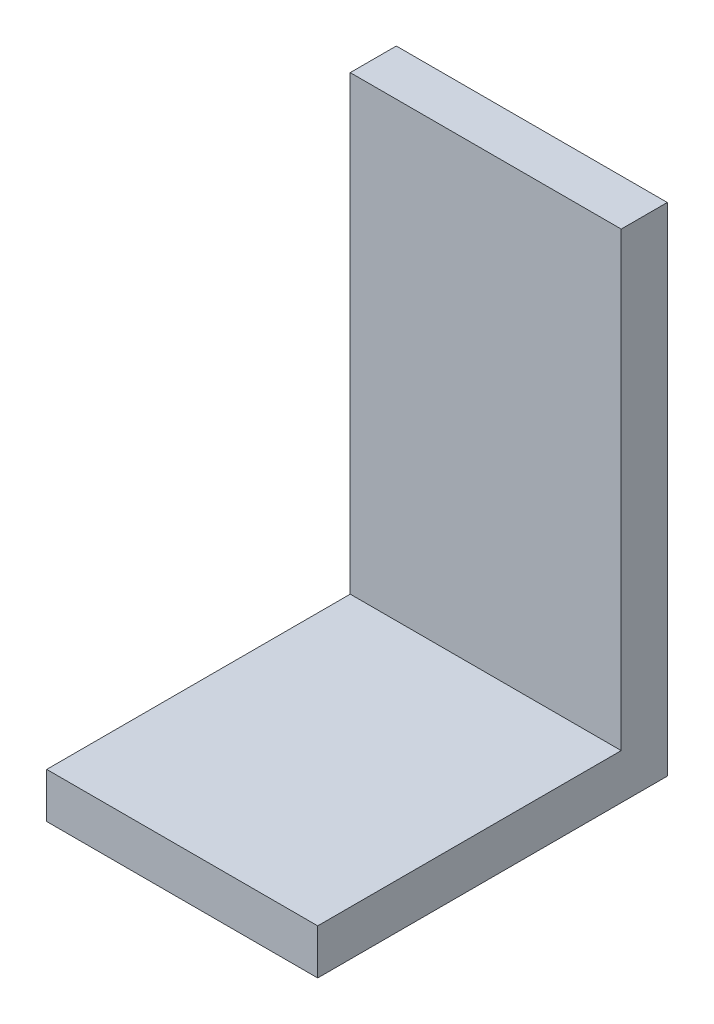
ISO-10303-21;
HEADER;
FILE_DESCRIPTION(('STEP AP214'),'2;1');
FILE_NAME('part.step','',(''),(''),'','','');
FILE_SCHEMA(('AUTOMOTIVE_DESIGN { 1 0 10303 214 1 1 1 1 }'));
ENDSEC;
DATA;
#1=APPLICATION_CONTEXT('core data for automotive mechanical design processes');
#2=APPLICATION_PROTOCOL_DEFINITION('international standard','automotive_design',2000,#1);
#3=PRODUCT_CONTEXT('',#1,'mechanical');
#4=PRODUCT('Part','Part','',(#3));
#5=PRODUCT_RELATED_PRODUCT_CATEGORY('part','',(#4));
#6=PRODUCT_DEFINITION_FORMATION('','',#4);
#7=PRODUCT_DEFINITION_CONTEXT('part definition',#1,'design');
#8=PRODUCT_DEFINITION('design','',#6,#7);
#9=PRODUCT_DEFINITION_SHAPE('','',#8);
#10=(LENGTH_UNIT() NAMED_UNIT(*) SI_UNIT(.MILLI.,.METRE.));
#11=(NAMED_UNIT(*) PLANE_ANGLE_UNIT() SI_UNIT($,.RADIAN.));
#12=(NAMED_UNIT(*) SI_UNIT($,.STERADIAN.) SOLID_ANGLE_UNIT());
#13=UNCERTAINTY_MEASURE_WITH_UNIT(LENGTH_MEASURE(1.E-05),#10,'distance_accuracy_value','');
#14=(GEOMETRIC_REPRESENTATION_CONTEXT(3) GLOBAL_UNCERTAINTY_ASSIGNED_CONTEXT((#13)) GLOBAL_UNIT_ASSIGNED_CONTEXT((#10,
#11,#12)) REPRESENTATION_CONTEXT('',''));
#15=CARTESIAN_POINT('',(0.,0.,0.));
#16=DIRECTION('',(0.,0.,1.));
#17=DIRECTION('',(1.,0.,0.));
#18=AXIS2_PLACEMENT_3D('',#15,#16,#17);
#19=CARTESIAN_POINT('',(-3.6,-4.55,0.));
#20=DIRECTION('',(1.,0.,0.));
#21=DIRECTION('',(0.,0.,1.));
#22=AXIS2_PLACEMENT_3D('',#19,#20,#21);
#23=PLANE('',#22);
#24=DIRECTION('',(0.,-1.,0.));
#25=VECTOR('',#24,1.);
#26=CARTESIAN_POINT('',(-3.6,-4.,0.));
#27=LINE('',#26,#25);
#28=CARTESIAN_POINT('',(-3.6,-4.,0.));
#29=VERTEX_POINT('',#28);
#30=CARTESIAN_POINT('',(-3.6,-4.55,0.));
#31=VERTEX_POINT('',#30);
#32=EDGE_CURVE('E11',#29,#31,#27,.T.);
#33=ORIENTED_EDGE('',*,*,#32,.F.);
#34=DIRECTION('',(0.,0.,-1.));
#35=VECTOR('',#34,1.);
#36=CARTESIAN_POINT('',(-3.6,-4.,0.051));
#37=LINE('',#36,#35);
#38=CARTESIAN_POINT('',(-3.6,-4.,0.051));
#39=VERTEX_POINT('',#38);
#40=EDGE_CURVE('E24',#39,#29,#37,.T.);
#41=ORIENTED_EDGE('',*,*,#40,.F.);
#42=DIRECTION('',(0.,1.,0.));
#43=VECTOR('',#42,1.);
#44=CARTESIAN_POINT('',(-3.6,-4.5,0.051));
#45=LINE('',#44,#43);
#46=CARTESIAN_POINT('',(-3.6,-4.5,0.051));
#47=VERTEX_POINT('',#46);
#48=EDGE_CURVE('E87',#47,#39,#45,.T.);
#49=ORIENTED_EDGE('',*,*,#48,.F.);
#50=DIRECTION('',(0.,0.,-1.));
#51=VECTOR('',#50,1.);
#52=CARTESIAN_POINT('',(-3.6,-4.5,0.387));
#53=LINE('',#52,#51);
#54=CARTESIAN_POINT('',(-3.6,-4.5,0.387));
#55=VERTEX_POINT('',#54);
#56=EDGE_CURVE('E114',#55,#47,#53,.T.);
#57=ORIENTED_EDGE('',*,*,#56,.F.);
#58=DIRECTION('',(0.,1.,0.));
#59=VECTOR('',#58,1.);
#60=CARTESIAN_POINT('',(-3.6,-4.55,0.387));
#61=LINE('',#60,#59);
#62=CARTESIAN_POINT('',(-3.6,-4.55,0.387));
#63=VERTEX_POINT('',#62);
#64=EDGE_CURVE('E111',#63,#55,#61,.T.);
#65=ORIENTED_EDGE('',*,*,#64,.F.);
#66=DIRECTION('',(0.,0.,1.));
#67=VECTOR('',#66,1.);
#68=CARTESIAN_POINT('',(-3.6,-4.55,0.));
#69=LINE('',#68,#67);
#70=EDGE_CURVE('E108',#31,#63,#69,.T.);
#71=ORIENTED_EDGE('',*,*,#70,.F.);
#72=EDGE_LOOP('',(#33,#41,#49,#57,#65,#71));
#73=FACE_BOUND('',#72,.T.);
#74=ADVANCED_FACE('F17',(#73),#23,.T.);
#75=CARTESIAN_POINT('',(-3.9,-4.,0.));
#76=DIRECTION('',(-1.,0.,0.));
#77=DIRECTION('',(0.,0.,1.));
#78=AXIS2_PLACEMENT_3D('',#75,#76,#77);
#79=PLANE('',#78);
#80=DIRECTION('',(0.,1.,0.));
#81=VECTOR('',#80,1.);
#82=CARTESIAN_POINT('',(-3.9,-4.55,0.));
#83=LINE('',#82,#81);
#84=CARTESIAN_POINT('',(-3.9,-4.55,0.));
#85=VERTEX_POINT('',#84);
#86=CARTESIAN_POINT('',(-3.9,-4.,0.));
#87=VERTEX_POINT('',#86);
#88=EDGE_CURVE('E106',#85,#87,#83,.T.);
#89=ORIENTED_EDGE('',*,*,#88,.F.);
#90=DIRECTION('',(0.,0.,-1.));
#91=VECTOR('',#90,1.);
#92=CARTESIAN_POINT('',(-3.9,-4.55,0.387));
#93=LINE('',#92,#91);
#94=CARTESIAN_POINT('',(-3.9,-4.55,0.387));
#95=VERTEX_POINT('',#94);
#96=EDGE_CURVE('E103',#95,#85,#93,.T.);
#97=ORIENTED_EDGE('',*,*,#96,.F.);
#98=DIRECTION('',(0.,-1.,0.));
#99=VECTOR('',#98,1.);
#100=CARTESIAN_POINT('',(-3.9,-4.5,0.387));
#101=LINE('',#100,#99);
#102=CARTESIAN_POINT('',(-3.9,-4.5,0.387));
#103=VERTEX_POINT('',#102);
#104=EDGE_CURVE('E100',#103,#95,#101,.T.);
#105=ORIENTED_EDGE('',*,*,#104,.F.);
#106=DIRECTION('',(0.,0.,1.));
#107=VECTOR('',#106,1.);
#108=CARTESIAN_POINT('',(-3.9,-4.5,0.051));
#109=LINE('',#108,#107);
#110=CARTESIAN_POINT('',(-3.9,-4.5,0.051));
#111=VERTEX_POINT('',#110);
#112=EDGE_CURVE('E72',#111,#103,#109,.T.);
#113=ORIENTED_EDGE('',*,*,#112,.F.);
#114=DIRECTION('',(0.,-1.,0.));
#115=VECTOR('',#114,1.);
#116=CARTESIAN_POINT('',(-3.9,-4.,0.051));
#117=LINE('',#116,#115);
#118=CARTESIAN_POINT('',(-3.9,-4.,0.051));
#119=VERTEX_POINT('',#118);
#120=EDGE_CURVE('E66',#119,#111,#117,.T.);
#121=ORIENTED_EDGE('',*,*,#120,.F.);
#122=DIRECTION('',(0.,0.,1.));
#123=VECTOR('',#122,1.);
#124=CARTESIAN_POINT('',(-3.9,-4.,0.));
#125=LINE('',#124,#123);
#126=EDGE_CURVE('E69',#87,#119,#125,.T.);
#127=ORIENTED_EDGE('',*,*,#126,.F.);
#128=EDGE_LOOP('',(#89,#97,#105,#113,#121,#127));
#129=FACE_BOUND('',#128,.T.);
#130=ADVANCED_FACE('F68',(#129),#79,.T.);
#131=CARTESIAN_POINT('',(-3.6,-4.55,0.387));
#132=DIRECTION('',(0.,0.,1.));
#133=DIRECTION('',(0.,1.,0.));
#134=AXIS2_PLACEMENT_3D('',#131,#132,#133);
#135=PLANE('',#134);
#136=ORIENTED_EDGE('',*,*,#64,.T.);
#137=DIRECTION('',(1.,0.,0.));
#138=VECTOR('',#137,1.);
#139=CARTESIAN_POINT('',(-3.9,-4.5,0.387));
#140=LINE('',#139,#138);
#141=EDGE_CURVE('E83',#103,#55,#140,.T.);
#142=ORIENTED_EDGE('',*,*,#141,.F.);
#143=ORIENTED_EDGE('',*,*,#104,.T.);
#144=DIRECTION('',(-1.,0.,0.));
#145=VECTOR('',#144,1.);
#146=CARTESIAN_POINT('',(-3.6,-4.55,0.387));
#147=LINE('',#146,#145);
#148=EDGE_CURVE('E88',#63,#95,#147,.T.);
#149=ORIENTED_EDGE('',*,*,#148,.F.);
#150=EDGE_LOOP('',(#136,#142,#143,#149));
#151=FACE_BOUND('',#150,.T.);
#152=ADVANCED_FACE('F125',(#151),#135,.T.);
#153=CARTESIAN_POINT('',(-3.6,-4.5,0.051));
#154=DIRECTION('',(0.,0.,1.));
#155=DIRECTION('',(0.,1.,0.));
#156=AXIS2_PLACEMENT_3D('',#153,#154,#155);
#157=PLANE('',#156);
#158=ORIENTED_EDGE('',*,*,#48,.T.);
#159=DIRECTION('',(1.,0.,0.));
#160=VECTOR('',#159,1.);
#161=CARTESIAN_POINT('',(-3.9,-4.,0.051));
#162=LINE('',#161,#160);
#163=EDGE_CURVE('E81',#119,#39,#162,.T.);
#164=ORIENTED_EDGE('',*,*,#163,.F.);
#165=ORIENTED_EDGE('',*,*,#120,.T.);
#166=DIRECTION('',(-1.,0.,0.));
#167=VECTOR('',#166,1.);
#168=CARTESIAN_POINT('',(-3.6,-4.5,0.051));
#169=LINE('',#168,#167);
#170=EDGE_CURVE('E89',#47,#111,#169,.T.);
#171=ORIENTED_EDGE('',*,*,#170,.F.);
#172=EDGE_LOOP('',(#158,#164,#165,#171));
#173=FACE_BOUND('',#172,.T.);
#174=ADVANCED_FACE('F86',(#173),#157,.T.);
#175=CARTESIAN_POINT('',(-3.9,-4.55,0.));
#176=DIRECTION('',(0.,-1.,0.));
#177=DIRECTION('',(0.,0.,1.));
#178=AXIS2_PLACEMENT_3D('',#175,#176,#177);
#179=PLANE('',#178);
#180=DIRECTION('',(-1.,0.,0.));
#181=VECTOR('',#180,1.);
#182=CARTESIAN_POINT('',(-3.6,-4.55,0.));
#183=LINE('',#182,#181);
#184=EDGE_CURVE('E93',#31,#85,#183,.T.);
#185=ORIENTED_EDGE('',*,*,#184,.F.);
#186=ORIENTED_EDGE('',*,*,#70,.T.);
#187=ORIENTED_EDGE('',*,*,#148,.T.);
#188=ORIENTED_EDGE('',*,*,#96,.T.);
#189=EDGE_LOOP('',(#185,#186,#187,#188));
#190=FACE_BOUND('',#189,.T.);
#191=ADVANCED_FACE('F121',(#190),#179,.T.);
#192=CARTESIAN_POINT('',(-3.6,-4.,0.));
#193=DIRECTION('',(0.,1.,0.));
#194=DIRECTION('',(0.,0.,1.));
#195=AXIS2_PLACEMENT_3D('',#192,#193,#194);
#196=PLANE('',#195);
#197=DIRECTION('',(1.,0.,0.));
#198=VECTOR('',#197,1.);
#199=CARTESIAN_POINT('',(-3.9,-4.,0.));
#200=LINE('',#199,#198);
#201=EDGE_CURVE('E82',#87,#29,#200,.T.);
#202=ORIENTED_EDGE('',*,*,#201,.F.);
#203=ORIENTED_EDGE('',*,*,#126,.T.);
#204=ORIENTED_EDGE('',*,*,#163,.T.);
#205=ORIENTED_EDGE('',*,*,#40,.T.);
#206=EDGE_LOOP('',(#202,#203,#204,#205));
#207=FACE_BOUND('',#206,.T.);
#208=ADVANCED_FACE('F80',(#207),#196,.T.);
#209=CARTESIAN_POINT('',(-3.6,-4.5,0.051));
#210=DIRECTION('',(0.,1.,0.));
#211=DIRECTION('',(0.,0.,1.));
#212=AXIS2_PLACEMENT_3D('',#209,#210,#211);
#213=PLANE('',#212);
#214=ORIENTED_EDGE('',*,*,#170,.T.);
#215=ORIENTED_EDGE('',*,*,#112,.T.);
#216=ORIENTED_EDGE('',*,*,#141,.T.);
#217=ORIENTED_EDGE('',*,*,#56,.T.);
#218=EDGE_LOOP('',(#214,#215,#216,#217));
#219=FACE_BOUND('',#218,.T.);
#220=ADVANCED_FACE('F127',(#219),#213,.T.);
#221=CARTESIAN_POINT('',(-3.9,-4.55,0.));
#222=DIRECTION('',(0.,0.,-1.));
#223=DIRECTION('',(0.,1.,0.));
#224=AXIS2_PLACEMENT_3D('',#221,#222,#223);
#225=PLANE('',#224);
#226=ORIENTED_EDGE('',*,*,#88,.T.);
#227=ORIENTED_EDGE('',*,*,#201,.T.);
#228=ORIENTED_EDGE('',*,*,#32,.T.);
#229=ORIENTED_EDGE('',*,*,#184,.T.);
#230=EDGE_LOOP('',(#226,#227,#228,#229));
#231=FACE_BOUND('',#230,.T.);
#232=ADVANCED_FACE('F117',(#231),#225,.T.);
#233=CLOSED_SHELL('',(#74,#130,#152,#174,#191,#208,#220,#232));
#234=MANIFOLD_SOLID_BREP('B1',#233);
#235=ADVANCED_BREP_SHAPE_REPRESENTATION('',(#18,#234),#14);
#236=SHAPE_DEFINITION_REPRESENTATION(#9,#235);
ENDSEC;
END-ISO-10303-21;
